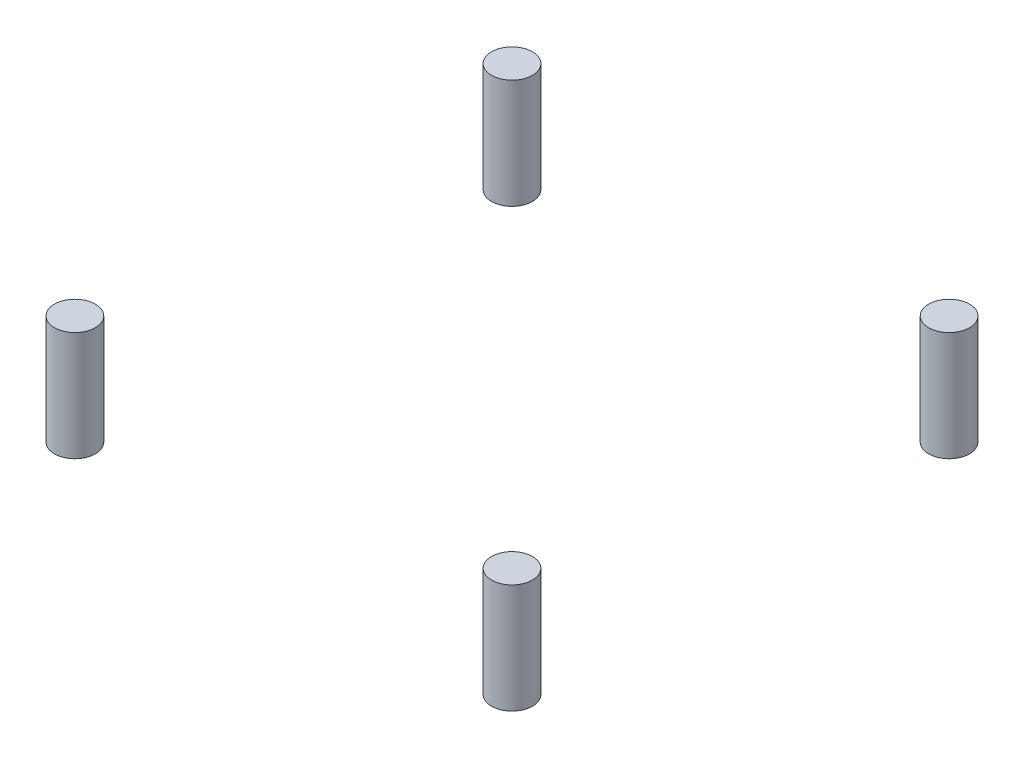
ISO-10303-21;
HEADER;
FILE_DESCRIPTION(('STEP AP214'),'2;1');
FILE_NAME('part.step','',(''),(''),'','','');
FILE_SCHEMA(('AUTOMOTIVE_DESIGN { 1 0 10303 214 1 1 1 1 }'));
ENDSEC;
DATA;
#1=APPLICATION_CONTEXT('core data for automotive mechanical design processes');
#2=APPLICATION_PROTOCOL_DEFINITION('international standard','automotive_design',2000,#1);
#3=PRODUCT_CONTEXT('',#1,'mechanical');
#4=PRODUCT('Part','Part','',(#3));
#5=PRODUCT_RELATED_PRODUCT_CATEGORY('part','',(#4));
#6=PRODUCT_DEFINITION_FORMATION('','',#4);
#7=PRODUCT_DEFINITION_CONTEXT('part definition',#1,'design');
#8=PRODUCT_DEFINITION('design','',#6,#7);
#9=PRODUCT_DEFINITION_SHAPE('','',#8);
#10=(LENGTH_UNIT() NAMED_UNIT(*) SI_UNIT(.MILLI.,.METRE.));
#11=(NAMED_UNIT(*) PLANE_ANGLE_UNIT() SI_UNIT($,.RADIAN.));
#12=(NAMED_UNIT(*) SI_UNIT($,.STERADIAN.) SOLID_ANGLE_UNIT());
#13=UNCERTAINTY_MEASURE_WITH_UNIT(LENGTH_MEASURE(1.E-05),#10,'distance_accuracy_value','');
#14=(GEOMETRIC_REPRESENTATION_CONTEXT(3) GLOBAL_UNCERTAINTY_ASSIGNED_CONTEXT((#13)) GLOBAL_UNIT_ASSIGNED_CONTEXT((#10,
#11,#12)) REPRESENTATION_CONTEXT('',''));
#15=CARTESIAN_POINT('',(0.,0.,0.));
#16=DIRECTION('',(0.,0.,1.));
#17=DIRECTION('',(1.,0.,0.));
#18=AXIS2_PLACEMENT_3D('',#15,#16,#17);
#19=CARTESIAN_POINT('',(-33.2003509729201,16.6,33.2003509729206));
#20=DIRECTION('',(0.,-1.,0.));
#21=DIRECTION('',(0.,0.,-1.));
#22=AXIS2_PLACEMENT_3D('',#19,#20,#21);
#23=CYLINDRICAL_SURFACE('',#22,3.10439474843176);
#24=CARTESIAN_POINT('',(-33.2003509729201,16.6,33.2003509729206));
#25=DIRECTION('',(0.,1.,0.));
#26=DIRECTION('',(0.,0.,1.));
#27=AXIS2_PLACEMENT_3D('',#24,#25,#26);
#28=CIRCLE('',#27,3.10439474843176);
#29=CARTESIAN_POINT('',(-33.2003509729201,16.6,36.3047457213524));
#30=VERTEX_POINT('',#29);
#31=EDGE_CURVE('E11',#30,#30,#28,.T.);
#32=ORIENTED_EDGE('',*,*,#31,.F.);
#33=EDGE_LOOP('',(#32));
#34=FACE_BOUND('',#33,.T.);
#35=CARTESIAN_POINT('',(-33.2003509729201,0.,33.2003509729206));
#36=DIRECTION('',(0.,1.,0.));
#37=DIRECTION('',(0.,0.,1.));
#38=AXIS2_PLACEMENT_3D('',#35,#36,#37);
#39=CIRCLE('',#38,3.10439474843176);
#40=CARTESIAN_POINT('',(-33.2003509729201,0.,36.3047457213524));
#41=VERTEX_POINT('',#40);
#42=EDGE_CURVE('E43',#41,#41,#39,.T.);
#43=ORIENTED_EDGE('',*,*,#42,.T.);
#44=EDGE_LOOP('',(#43));
#45=FACE_BOUND('',#44,.T.);
#46=ADVANCED_FACE('F40',(#34,#45),#23,.T.);
#47=CARTESIAN_POINT('',(-33.2003509729201,16.6,33.2003509729206));
#48=DIRECTION('',(0.,1.,0.));
#49=DIRECTION('',(0.,0.,1.));
#50=AXIS2_PLACEMENT_3D('',#47,#48,#49);
#51=PLANE('',#50);
#52=ORIENTED_EDGE('',*,*,#31,.T.);
#53=EDGE_LOOP('',(#52));
#54=FACE_BOUND('',#53,.T.);
#55=ADVANCED_FACE('F55',(#54),#51,.T.);
#56=CARTESIAN_POINT('',(-33.2003509729201,0.,33.2003509729206));
#57=DIRECTION('',(0.,1.,0.));
#58=DIRECTION('',(0.,0.,1.));
#59=AXIS2_PLACEMENT_3D('',#56,#57,#58);
#60=PLANE('',#59);
#61=ORIENTED_EDGE('',*,*,#42,.F.);
#62=EDGE_LOOP('',(#61));
#63=FACE_BOUND('',#62,.T.);
#64=ADVANCED_FACE('F53',(#63),#60,.F.);
#65=CLOSED_SHELL('',(#46,#55,#64));
#66=MANIFOLD_SOLID_BREP('B2',#65);
#67=CARTESIAN_POINT('',(33.2003509729206,16.6,33.2003509729201));
#68=DIRECTION('',(0.,-1.,0.));
#69=DIRECTION('',(0.,0.,-1.));
#70=AXIS2_PLACEMENT_3D('',#67,#68,#69);
#71=CYLINDRICAL_SURFACE('',#70,3.10439474843176);
#72=CARTESIAN_POINT('',(33.2003509729206,16.6,33.2003509729201));
#73=DIRECTION('',(0.,1.,0.));
#74=DIRECTION('',(0.,0.,1.));
#75=AXIS2_PLACEMENT_3D('',#72,#73,#74);
#76=CIRCLE('',#75,3.10439474843176);
#77=CARTESIAN_POINT('',(33.2003509729206,16.6,36.3047457213519));
#78=VERTEX_POINT('',#77);
#79=EDGE_CURVE('E39',#78,#78,#76,.T.);
#80=ORIENTED_EDGE('',*,*,#79,.F.);
#81=EDGE_LOOP('',(#80));
#82=FACE_BOUND('',#81,.T.);
#83=CARTESIAN_POINT('',(33.2003509729206,0.,33.2003509729201));
#84=DIRECTION('',(0.,1.,0.));
#85=DIRECTION('',(0.,0.,1.));
#86=AXIS2_PLACEMENT_3D('',#83,#84,#85);
#87=CIRCLE('',#86,3.10439474843176);
#88=CARTESIAN_POINT('',(33.2003509729206,0.,36.3047457213519));
#89=VERTEX_POINT('',#88);
#90=EDGE_CURVE('E92',#89,#89,#87,.T.);
#91=ORIENTED_EDGE('',*,*,#90,.T.);
#92=EDGE_LOOP('',(#91));
#93=FACE_BOUND('',#92,.T.);
#94=ADVANCED_FACE('F89',(#82,#93),#71,.T.);
#95=CARTESIAN_POINT('',(33.2003509729206,16.6,33.2003509729201));
#96=DIRECTION('',(0.,1.,0.));
#97=DIRECTION('',(0.,0.,1.));
#98=AXIS2_PLACEMENT_3D('',#95,#96,#97);
#99=PLANE('',#98);
#100=ORIENTED_EDGE('',*,*,#79,.T.);
#101=EDGE_LOOP('',(#100));
#102=FACE_BOUND('',#101,.T.);
#103=ADVANCED_FACE('F104',(#102),#99,.T.);
#104=CARTESIAN_POINT('',(33.2003509729206,0.,33.2003509729201));
#105=DIRECTION('',(0.,1.,0.));
#106=DIRECTION('',(0.,0.,1.));
#107=AXIS2_PLACEMENT_3D('',#104,#105,#106);
#108=PLANE('',#107);
#109=ORIENTED_EDGE('',*,*,#90,.F.);
#110=EDGE_LOOP('',(#109));
#111=FACE_BOUND('',#110,.T.);
#112=ADVANCED_FACE('F102',(#111),#108,.F.);
#113=CLOSED_SHELL('',(#94,#103,#112));
#114=MANIFOLD_SOLID_BREP('B6',#113);
#115=CARTESIAN_POINT('',(33.2003509729201,16.6,-33.2003509729206));
#116=DIRECTION('',(0.,-1.,0.));
#117=DIRECTION('',(0.,0.,-1.));
#118=AXIS2_PLACEMENT_3D('',#115,#116,#117);
#119=CYLINDRICAL_SURFACE('',#118,3.10439474843175);
#120=CARTESIAN_POINT('',(33.2003509729201,16.6,-33.2003509729206));
#121=DIRECTION('',(0.,1.,0.));
#122=DIRECTION('',(0.,0.,1.));
#123=AXIS2_PLACEMENT_3D('',#120,#121,#122);
#124=CIRCLE('',#123,3.10439474843175);
#125=CARTESIAN_POINT('',(33.2003509729201,16.6,-30.0959562244889));
#126=VERTEX_POINT('',#125);
#127=EDGE_CURVE('E88',#126,#126,#124,.T.);
#128=ORIENTED_EDGE('',*,*,#127,.F.);
#129=EDGE_LOOP('',(#128));
#130=FACE_BOUND('',#129,.T.);
#131=CARTESIAN_POINT('',(33.2003509729201,0.,-33.2003509729206));
#132=DIRECTION('',(0.,1.,0.));
#133=DIRECTION('',(0.,0.,1.));
#134=AXIS2_PLACEMENT_3D('',#131,#132,#133);
#135=CIRCLE('',#134,3.10439474843175);
#136=CARTESIAN_POINT('',(33.2003509729201,0.,-30.0959562244889));
#137=VERTEX_POINT('',#136);
#138=EDGE_CURVE('E140',#137,#137,#135,.T.);
#139=ORIENTED_EDGE('',*,*,#138,.T.);
#140=EDGE_LOOP('',(#139));
#141=FACE_BOUND('',#140,.T.);
#142=ADVANCED_FACE('F137',(#130,#141),#119,.T.);
#143=CARTESIAN_POINT('',(33.2003509729201,16.6,-33.2003509729206));
#144=DIRECTION('',(0.,1.,0.));
#145=DIRECTION('',(0.,0.,1.));
#146=AXIS2_PLACEMENT_3D('',#143,#144,#145);
#147=PLANE('',#146);
#148=ORIENTED_EDGE('',*,*,#127,.T.);
#149=EDGE_LOOP('',(#148));
#150=FACE_BOUND('',#149,.T.);
#151=ADVANCED_FACE('F152',(#150),#147,.T.);
#152=CARTESIAN_POINT('',(33.2003509729201,0.,-33.2003509729206));
#153=DIRECTION('',(0.,1.,0.));
#154=DIRECTION('',(0.,0.,1.));
#155=AXIS2_PLACEMENT_3D('',#152,#153,#154);
#156=PLANE('',#155);
#157=ORIENTED_EDGE('',*,*,#138,.F.);
#158=EDGE_LOOP('',(#157));
#159=FACE_BOUND('',#158,.T.);
#160=ADVANCED_FACE('F150',(#159),#156,.F.);
#161=CLOSED_SHELL('',(#142,#151,#160));
#162=MANIFOLD_SOLID_BREP('B34',#161);
#163=CARTESIAN_POINT('',(-33.2003509729206,16.6,-33.2003509729201));
#164=DIRECTION('',(0.,-1.,0.));
#165=DIRECTION('',(0.,0.,-1.));
#166=AXIS2_PLACEMENT_3D('',#163,#164,#165);
#167=CYLINDRICAL_SURFACE('',#166,3.10439474843176);
#168=CARTESIAN_POINT('',(-33.2003509729206,16.6,-33.2003509729201));
#169=DIRECTION('',(0.,1.,0.));
#170=DIRECTION('',(0.,0.,1.));
#171=AXIS2_PLACEMENT_3D('',#168,#169,#170);
#172=CIRCLE('',#171,3.10439474843176);
#173=CARTESIAN_POINT('',(-33.2003509729206,16.6,-30.0959562244884));
#174=VERTEX_POINT('',#173);
#175=EDGE_CURVE('E136',#174,#174,#172,.T.);
#176=ORIENTED_EDGE('',*,*,#175,.F.);
#177=EDGE_LOOP('',(#176));
#178=FACE_BOUND('',#177,.T.);
#179=CARTESIAN_POINT('',(-33.2003509729206,0.,-33.2003509729201));
#180=DIRECTION('',(0.,1.,0.));
#181=DIRECTION('',(0.,0.,1.));
#182=AXIS2_PLACEMENT_3D('',#179,#180,#181);
#183=CIRCLE('',#182,3.10439474843176);
#184=CARTESIAN_POINT('',(-33.2003509729206,0.,-30.0959562244884));
#185=VERTEX_POINT('',#184);
#186=EDGE_CURVE('E181',#185,#185,#183,.T.);
#187=ORIENTED_EDGE('',*,*,#186,.T.);
#188=EDGE_LOOP('',(#187));
#189=FACE_BOUND('',#188,.T.);
#190=ADVANCED_FACE('F178',(#178,#189),#167,.T.);
#191=CARTESIAN_POINT('',(-33.2003509729206,16.6,-33.2003509729201));
#192=DIRECTION('',(0.,1.,0.));
#193=DIRECTION('',(0.,0.,1.));
#194=AXIS2_PLACEMENT_3D('',#191,#192,#193);
#195=PLANE('',#194);
#196=ORIENTED_EDGE('',*,*,#175,.T.);
#197=EDGE_LOOP('',(#196));
#198=FACE_BOUND('',#197,.T.);
#199=ADVANCED_FACE('F193',(#198),#195,.T.);
#200=CARTESIAN_POINT('',(-33.2003509729206,0.,-33.2003509729201));
#201=DIRECTION('',(0.,1.,0.));
#202=DIRECTION('',(0.,0.,1.));
#203=AXIS2_PLACEMENT_3D('',#200,#201,#202);
#204=PLANE('',#203);
#205=ORIENTED_EDGE('',*,*,#186,.F.);
#206=EDGE_LOOP('',(#205));
#207=FACE_BOUND('',#206,.T.);
#208=ADVANCED_FACE('F191',(#207),#204,.F.);
#209=CLOSED_SHELL('',(#190,#199,#208));
#210=MANIFOLD_SOLID_BREP('B83',#209);
#211=ADVANCED_BREP_SHAPE_REPRESENTATION('',(#18,#66,#114,#162,#210),#14);
#212=SHAPE_DEFINITION_REPRESENTATION(#9,#211);
ENDSEC;
END-ISO-10303-21;
